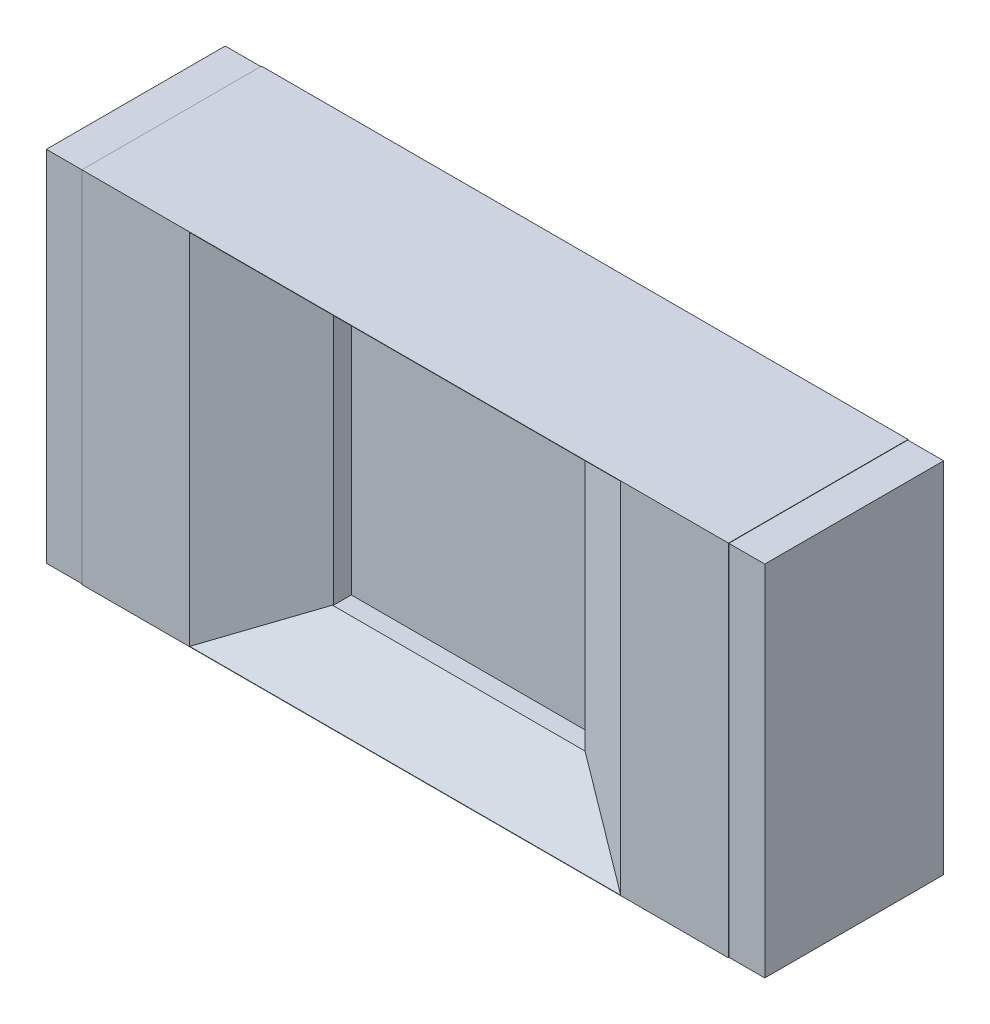
ISO-10303-21;
HEADER;
FILE_DESCRIPTION(('STEP AP214'),'2;1');
FILE_NAME('part.step','',(''),(''),'','','');
FILE_SCHEMA(('AUTOMOTIVE_DESIGN { 1 0 10303 214 1 1 1 1 }'));
ENDSEC;
DATA;
#1=APPLICATION_CONTEXT('core data for automotive mechanical design processes');
#2=APPLICATION_PROTOCOL_DEFINITION('international standard','automotive_design',2000,#1);
#3=PRODUCT_CONTEXT('',#1,'mechanical');
#4=PRODUCT('Part','Part','',(#3));
#5=PRODUCT_RELATED_PRODUCT_CATEGORY('part','',(#4));
#6=PRODUCT_DEFINITION_FORMATION('','',#4);
#7=PRODUCT_DEFINITION_CONTEXT('part definition',#1,'design');
#8=PRODUCT_DEFINITION('design','',#6,#7);
#9=PRODUCT_DEFINITION_SHAPE('','',#8);
#10=(LENGTH_UNIT() NAMED_UNIT(*) SI_UNIT(.MILLI.,.METRE.));
#11=(NAMED_UNIT(*) PLANE_ANGLE_UNIT() SI_UNIT($,.RADIAN.));
#12=(NAMED_UNIT(*) SI_UNIT($,.STERADIAN.) SOLID_ANGLE_UNIT());
#13=UNCERTAINTY_MEASURE_WITH_UNIT(LENGTH_MEASURE(1.E-05),#10,'distance_accuracy_value','');
#14=(GEOMETRIC_REPRESENTATION_CONTEXT(3) GLOBAL_UNCERTAINTY_ASSIGNED_CONTEXT((#13)) GLOBAL_UNIT_ASSIGNED_CONTEXT((#10,
#11,#12)) REPRESENTATION_CONTEXT('',''));
#15=CARTESIAN_POINT('',(0.,0.,0.));
#16=DIRECTION('',(0.,0.,1.));
#17=DIRECTION('',(1.,0.,0.));
#18=AXIS2_PLACEMENT_3D('',#15,#16,#17);
#19=CARTESIAN_POINT('',(28.13,-12.,3.201));
#20=DIRECTION('',(0.,0.,-1.));
#21=DIRECTION('',(0.,-1.,0.));
#22=AXIS2_PLACEMENT_3D('',#19,#20,#21);
#23=PLANE('',#22);
#24=DIRECTION('',(1.,0.,0.));
#25=VECTOR('',#24,1.);
#26=CARTESIAN_POINT('',(28.13,-11.999,3.201));
#27=LINE('',#26,#25);
#28=CARTESIAN_POINT('',(28.03,-11.999,3.201));
#29=VERTEX_POINT('',#28);
#30=CARTESIAN_POINT('',(28.13,-11.999,3.201));
#31=VERTEX_POINT('',#30);
#32=EDGE_CURVE('E339',#29,#31,#27,.T.);
#33=ORIENTED_EDGE('',*,*,#32,.F.);
#34=DIRECTION('',(0.,-1.,0.));
#35=VECTOR('',#34,1.);
#36=CARTESIAN_POINT('',(28.03,-12.,3.201));
#37=LINE('',#36,#35);
#38=CARTESIAN_POINT('',(28.03,-11.001,3.201));
#39=VERTEX_POINT('',#38);
#40=EDGE_CURVE('E11',#39,#29,#37,.T.);
#41=ORIENTED_EDGE('',*,*,#40,.F.);
#42=DIRECTION('',(1.,0.,0.));
#43=VECTOR('',#42,1.);
#44=CARTESIAN_POINT('',(28.13,-11.001,3.201));
#45=LINE('',#44,#43);
#46=CARTESIAN_POINT('',(28.13,-11.001,3.201));
#47=VERTEX_POINT('',#46);
#48=EDGE_CURVE('E368',#39,#47,#45,.T.);
#49=ORIENTED_EDGE('',*,*,#48,.T.);
#50=DIRECTION('',(0.,-1.,0.));
#51=VECTOR('',#50,1.);
#52=CARTESIAN_POINT('',(28.13,-12.,3.201));
#53=LINE('',#52,#51);
#54=EDGE_CURVE('E252',#47,#31,#53,.T.);
#55=ORIENTED_EDGE('',*,*,#54,.T.);
#56=EDGE_LOOP('',(#33,#41,#49,#55));
#57=FACE_BOUND('',#56,.T.);
#58=ADVANCED_FACE('F18',(#57),#23,.T.);
#59=CARTESIAN_POINT('',(28.03,-12.,3.2));
#60=DIRECTION('',(-1.,0.,0.));
#61=DIRECTION('',(0.,0.,1.));
#62=AXIS2_PLACEMENT_3D('',#59,#60,#61);
#63=PLANE('',#62);
#64=ORIENTED_EDGE('',*,*,#40,.T.);
#65=DIRECTION('',(0.,0.,1.));
#66=VECTOR('',#65,1.);
#67=CARTESIAN_POINT('',(28.03,-11.999,3.2));
#68=LINE('',#67,#66);
#69=CARTESIAN_POINT('',(28.03,-11.999,3.699));
#70=VERTEX_POINT('',#69);
#71=EDGE_CURVE('E242',#29,#70,#68,.T.);
#72=ORIENTED_EDGE('',*,*,#71,.T.);
#73=DIRECTION('',(0.,1.,0.));
#74=VECTOR('',#73,1.);
#75=CARTESIAN_POINT('',(28.03,-12.,3.699));
#76=LINE('',#75,#74);
#77=CARTESIAN_POINT('',(28.03,-11.001,3.699));
#78=VERTEX_POINT('',#77);
#79=EDGE_CURVE('E243',#70,#78,#76,.T.);
#80=ORIENTED_EDGE('',*,*,#79,.T.);
#81=DIRECTION('',(0.,0.,-1.));
#82=VECTOR('',#81,1.);
#83=CARTESIAN_POINT('',(28.03,-11.001,3.2));
#84=LINE('',#83,#82);
#85=EDGE_CURVE('E29',#78,#39,#84,.T.);
#86=ORIENTED_EDGE('',*,*,#85,.T.);
#87=EDGE_LOOP('',(#64,#72,#80,#86));
#88=FACE_BOUND('',#87,.T.);
#89=ADVANCED_FACE('F468',(#88),#63,.T.);
#90=CARTESIAN_POINT('',(28.13,-11.001,3.2));
#91=DIRECTION('',(0.,1.,0.));
#92=DIRECTION('',(1.,0.,0.));
#93=AXIS2_PLACEMENT_3D('',#90,#91,#92);
#94=PLANE('',#93);
#95=ORIENTED_EDGE('',*,*,#48,.F.);
#96=ORIENTED_EDGE('',*,*,#85,.F.);
#97=DIRECTION('',(1.,0.,0.));
#98=VECTOR('',#97,1.);
#99=CARTESIAN_POINT('',(28.13,-11.001,3.699));
#100=LINE('',#99,#98);
#101=CARTESIAN_POINT('',(28.13,-11.001,3.699));
#102=VERTEX_POINT('',#101);
#103=EDGE_CURVE('E285',#78,#102,#100,.T.);
#104=ORIENTED_EDGE('',*,*,#103,.T.);
#105=DIRECTION('',(0.,0.,-1.));
#106=VECTOR('',#105,1.);
#107=CARTESIAN_POINT('',(28.13,-11.001,3.2));
#108=LINE('',#107,#106);
#109=EDGE_CURVE('E281',#102,#47,#108,.T.);
#110=ORIENTED_EDGE('',*,*,#109,.T.);
#111=EDGE_LOOP('',(#95,#96,#104,#110));
#112=FACE_BOUND('',#111,.T.);
#113=ADVANCED_FACE('F473',(#112),#94,.T.);
#114=CARTESIAN_POINT('',(28.13,-11.999,3.2));
#115=DIRECTION('',(0.,-1.,0.));
#116=DIRECTION('',(-1.,0.,0.));
#117=AXIS2_PLACEMENT_3D('',#114,#115,#116);
#118=PLANE('',#117);
#119=DIRECTION('',(1.,0.,0.));
#120=VECTOR('',#119,1.);
#121=CARTESIAN_POINT('',(28.13,-11.999,3.699));
#122=LINE('',#121,#120);
#123=CARTESIAN_POINT('',(28.13,-11.999,3.699));
#124=VERTEX_POINT('',#123);
#125=EDGE_CURVE('E238',#70,#124,#122,.T.);
#126=ORIENTED_EDGE('',*,*,#125,.F.);
#127=ORIENTED_EDGE('',*,*,#71,.F.);
#128=ORIENTED_EDGE('',*,*,#32,.T.);
#129=DIRECTION('',(0.,0.,1.));
#130=VECTOR('',#129,1.);
#131=CARTESIAN_POINT('',(28.13,-11.999,3.2));
#132=LINE('',#131,#130);
#133=EDGE_CURVE('E248',#31,#124,#132,.T.);
#134=ORIENTED_EDGE('',*,*,#133,.T.);
#135=EDGE_LOOP('',(#126,#127,#128,#134));
#136=FACE_BOUND('',#135,.T.);
#137=ADVANCED_FACE('F518',(#136),#118,.T.);
#138=CARTESIAN_POINT('',(28.13,-12.,3.699));
#139=DIRECTION('',(0.,0.,1.));
#140=DIRECTION('',(1.,0.,0.));
#141=AXIS2_PLACEMENT_3D('',#138,#139,#140);
#142=PLANE('',#141);
#143=ORIENTED_EDGE('',*,*,#103,.F.);
#144=ORIENTED_EDGE('',*,*,#79,.F.);
#145=ORIENTED_EDGE('',*,*,#125,.T.);
#146=DIRECTION('',(0.,1.,0.));
#147=VECTOR('',#146,1.);
#148=CARTESIAN_POINT('',(28.13,-12.,3.699));
#149=LINE('',#148,#147);
#150=EDGE_CURVE('E22',#124,#102,#149,.T.);
#151=ORIENTED_EDGE('',*,*,#150,.T.);
#152=EDGE_LOOP('',(#143,#144,#145,#151));
#153=FACE_BOUND('',#152,.T.);
#154=ADVANCED_FACE('F511',(#153),#142,.T.);
#155=CARTESIAN_POINT('',(28.13,-11.5,3.45));
#156=DIRECTION('',(-1.,0.,0.));
#157=DIRECTION('',(0.,0.,1.));
#158=AXIS2_PLACEMENT_3D('',#155,#156,#157);
#159=PLANE('',#158);
#160=ORIENTED_EDGE('',*,*,#150,.F.);
#161=ORIENTED_EDGE('',*,*,#133,.F.);
#162=ORIENTED_EDGE('',*,*,#54,.F.);
#163=ORIENTED_EDGE('',*,*,#109,.F.);
#164=EDGE_LOOP('',(#160,#161,#162,#163));
#165=FACE_BOUND('',#164,.T.);
#166=DIRECTION('',(0.,1.,0.));
#167=VECTOR('',#166,1.);
#168=CARTESIAN_POINT('',(28.13,-12.,3.7));
#169=LINE('',#168,#167);
#170=CARTESIAN_POINT('',(28.13,-12.,3.7));
#171=VERTEX_POINT('',#170);
#172=CARTESIAN_POINT('',(28.13,-11.,3.7));
#173=VERTEX_POINT('',#172);
#174=EDGE_CURVE('E225',#171,#173,#169,.T.);
#175=ORIENTED_EDGE('',*,*,#174,.T.);
#176=DIRECTION('',(0.,0.,-1.));
#177=VECTOR('',#176,1.);
#178=CARTESIAN_POINT('',(28.13,-11.,3.2));
#179=LINE('',#178,#177);
#180=CARTESIAN_POINT('',(28.13,-11.,3.2));
#181=VERTEX_POINT('',#180);
#182=EDGE_CURVE('E290',#173,#181,#179,.T.);
#183=ORIENTED_EDGE('',*,*,#182,.T.);
#184=DIRECTION('',(0.,-1.,0.));
#185=VECTOR('',#184,1.);
#186=CARTESIAN_POINT('',(28.13,-12.,3.2));
#187=LINE('',#186,#185);
#188=CARTESIAN_POINT('',(28.13,-12.,3.2));
#189=VERTEX_POINT('',#188);
#190=EDGE_CURVE('E269',#181,#189,#187,.T.);
#191=ORIENTED_EDGE('',*,*,#190,.T.);
#192=DIRECTION('',(0.,0.,1.));
#193=VECTOR('',#192,1.);
#194=CARTESIAN_POINT('',(28.13,-12.,3.2));
#195=LINE('',#194,#193);
#196=EDGE_CURVE('E279',#189,#171,#195,.T.);
#197=ORIENTED_EDGE('',*,*,#196,.T.);
#198=EDGE_LOOP('',(#175,#183,#191,#197));
#199=FACE_BOUND('',#198,.T.);
#200=ADVANCED_FACE('F504',(#165,#199),#159,.T.);
#201=CARTESIAN_POINT('',(29.93,-12.,3.201));
#202=DIRECTION('',(0.,0.,-1.));
#203=DIRECTION('',(-1.,0.,0.));
#204=AXIS2_PLACEMENT_3D('',#201,#202,#203);
#205=PLANE('',#204);
#206=DIRECTION('',(0.,-1.,0.));
#207=VECTOR('',#206,1.);
#208=CARTESIAN_POINT('',(29.93,-12.,3.201));
#209=LINE('',#208,#207);
#210=CARTESIAN_POINT('',(29.93,-11.001,3.201));
#211=VERTEX_POINT('',#210);
#212=CARTESIAN_POINT('',(29.93,-11.999,3.201));
#213=VERTEX_POINT('',#212);
#214=EDGE_CURVE('E253',#211,#213,#209,.T.);
#215=ORIENTED_EDGE('',*,*,#214,.F.);
#216=DIRECTION('',(-1.,0.,0.));
#217=VECTOR('',#216,1.);
#218=CARTESIAN_POINT('',(29.93,-11.001,3.201));
#219=LINE('',#218,#217);
#220=CARTESIAN_POINT('',(30.03,-11.001,3.201));
#221=VERTEX_POINT('',#220);
#222=EDGE_CURVE('E219',#221,#211,#219,.T.);
#223=ORIENTED_EDGE('',*,*,#222,.F.);
#224=DIRECTION('',(0.,-1.,0.));
#225=VECTOR('',#224,1.);
#226=CARTESIAN_POINT('',(30.03,-12.,3.201));
#227=LINE('',#226,#225);
#228=CARTESIAN_POINT('',(30.03,-11.999,3.201));
#229=VERTEX_POINT('',#228);
#230=EDGE_CURVE('E216',#221,#229,#227,.T.);
#231=ORIENTED_EDGE('',*,*,#230,.T.);
#232=DIRECTION('',(-1.,0.,0.));
#233=VECTOR('',#232,1.);
#234=CARTESIAN_POINT('',(29.93,-11.999,3.201));
#235=LINE('',#234,#233);
#236=EDGE_CURVE('E365',#229,#213,#235,.T.);
#237=ORIENTED_EDGE('',*,*,#236,.T.);
#238=EDGE_LOOP('',(#215,#223,#231,#237));
#239=FACE_BOUND('',#238,.T.);
#240=ADVANCED_FACE('F502',(#239),#205,.T.);
#241=CARTESIAN_POINT('',(30.03,-11.,3.2));
#242=DIRECTION('',(1.,0.,0.));
#243=DIRECTION('',(0.,1.,0.));
#244=AXIS2_PLACEMENT_3D('',#241,#242,#243);
#245=PLANE('',#244);
#246=ORIENTED_EDGE('',*,*,#230,.F.);
#247=DIRECTION('',(0.,0.,-1.));
#248=VECTOR('',#247,1.);
#249=CARTESIAN_POINT('',(30.03,-11.001,3.2));
#250=LINE('',#249,#248);
#251=CARTESIAN_POINT('',(30.03,-11.001,3.699));
#252=VERTEX_POINT('',#251);
#253=EDGE_CURVE('E237',#252,#221,#250,.T.);
#254=ORIENTED_EDGE('',*,*,#253,.F.);
#255=DIRECTION('',(0.,1.,0.));
#256=VECTOR('',#255,1.);
#257=CARTESIAN_POINT('',(30.03,-12.,3.699));
#258=LINE('',#257,#256);
#259=CARTESIAN_POINT('',(30.03,-11.999,3.699));
#260=VERTEX_POINT('',#259);
#261=EDGE_CURVE('E303',#260,#252,#258,.T.);
#262=ORIENTED_EDGE('',*,*,#261,.F.);
#263=DIRECTION('',(0.,0.,1.));
#264=VECTOR('',#263,1.);
#265=CARTESIAN_POINT('',(30.03,-11.999,3.2));
#266=LINE('',#265,#264);
#267=EDGE_CURVE('E262',#229,#260,#266,.T.);
#268=ORIENTED_EDGE('',*,*,#267,.F.);
#269=EDGE_LOOP('',(#246,#254,#262,#268));
#270=FACE_BOUND('',#269,.T.);
#271=ADVANCED_FACE('F493',(#270),#245,.T.);
#272=CARTESIAN_POINT('',(29.93,-11.001,3.2));
#273=DIRECTION('',(0.,1.,0.));
#274=DIRECTION('',(1.,0.,0.));
#275=AXIS2_PLACEMENT_3D('',#272,#273,#274);
#276=PLANE('',#275);
#277=DIRECTION('',(0.,0.,-1.));
#278=VECTOR('',#277,1.);
#279=CARTESIAN_POINT('',(29.93,-11.001,3.2));
#280=LINE('',#279,#278);
#281=CARTESIAN_POINT('',(29.93,-11.001,3.699));
#282=VERTEX_POINT('',#281);
#283=EDGE_CURVE('E258',#282,#211,#280,.T.);
#284=ORIENTED_EDGE('',*,*,#283,.F.);
#285=DIRECTION('',(-1.,0.,0.));
#286=VECTOR('',#285,1.);
#287=CARTESIAN_POINT('',(29.93,-11.001,3.699));
#288=LINE('',#287,#286);
#289=EDGE_CURVE('E213',#252,#282,#288,.T.);
#290=ORIENTED_EDGE('',*,*,#289,.F.);
#291=ORIENTED_EDGE('',*,*,#253,.T.);
#292=ORIENTED_EDGE('',*,*,#222,.T.);
#293=EDGE_LOOP('',(#284,#290,#291,#292));
#294=FACE_BOUND('',#293,.T.);
#295=ADVANCED_FACE('F386',(#294),#276,.T.);
#296=CARTESIAN_POINT('',(29.93,-11.999,3.2));
#297=DIRECTION('',(0.,-1.,0.));
#298=DIRECTION('',(0.,0.,-1.));
#299=AXIS2_PLACEMENT_3D('',#296,#297,#298);
#300=PLANE('',#299);
#301=DIRECTION('',(0.,0.,1.));
#302=VECTOR('',#301,1.);
#303=CARTESIAN_POINT('',(29.93,-11.999,3.2));
#304=LINE('',#303,#302);
#305=CARTESIAN_POINT('',(29.93,-11.999,3.699));
#306=VERTEX_POINT('',#305);
#307=EDGE_CURVE('E257',#213,#306,#304,.T.);
#308=ORIENTED_EDGE('',*,*,#307,.F.);
#309=ORIENTED_EDGE('',*,*,#236,.F.);
#310=ORIENTED_EDGE('',*,*,#267,.T.);
#311=DIRECTION('',(-1.,0.,0.));
#312=VECTOR('',#311,1.);
#313=CARTESIAN_POINT('',(29.93,-11.999,3.699));
#314=LINE('',#313,#312);
#315=EDGE_CURVE('E266',#260,#306,#314,.T.);
#316=ORIENTED_EDGE('',*,*,#315,.T.);
#317=EDGE_LOOP('',(#308,#309,#310,#316));
#318=FACE_BOUND('',#317,.T.);
#319=ADVANCED_FACE('F485',(#318),#300,.T.);
#320=CARTESIAN_POINT('',(29.93,-12.,3.699));
#321=DIRECTION('',(0.,0.,1.));
#322=DIRECTION('',(1.,0.,0.));
#323=AXIS2_PLACEMENT_3D('',#320,#321,#322);
#324=PLANE('',#323);
#325=DIRECTION('',(0.,1.,0.));
#326=VECTOR('',#325,1.);
#327=CARTESIAN_POINT('',(29.93,-12.,3.699));
#328=LINE('',#327,#326);
#329=EDGE_CURVE('E321',#306,#282,#328,.T.);
#330=ORIENTED_EDGE('',*,*,#329,.F.);
#331=ORIENTED_EDGE('',*,*,#315,.F.);
#332=ORIENTED_EDGE('',*,*,#261,.T.);
#333=ORIENTED_EDGE('',*,*,#289,.T.);
#334=EDGE_LOOP('',(#330,#331,#332,#333));
#335=FACE_BOUND('',#334,.T.);
#336=ADVANCED_FACE('F480',(#335),#324,.T.);
#337=CARTESIAN_POINT('',(29.93,-11.5,3.45));
#338=DIRECTION('',(1.,0.,0.));
#339=DIRECTION('',(0.,1.,0.));
#340=AXIS2_PLACEMENT_3D('',#337,#338,#339);
#341=PLANE('',#340);
#342=ORIENTED_EDGE('',*,*,#329,.T.);
#343=ORIENTED_EDGE('',*,*,#283,.T.);
#344=ORIENTED_EDGE('',*,*,#214,.T.);
#345=ORIENTED_EDGE('',*,*,#307,.T.);
#346=EDGE_LOOP('',(#342,#343,#344,#345));
#347=FACE_BOUND('',#346,.T.);
#348=DIRECTION('',(0.,1.,0.));
#349=VECTOR('',#348,1.);
#350=CARTESIAN_POINT('',(29.93,-12.,3.7));
#351=LINE('',#350,#349);
#352=CARTESIAN_POINT('',(29.93,-12.,3.7));
#353=VERTEX_POINT('',#352);
#354=CARTESIAN_POINT('',(29.93,-11.,3.7));
#355=VERTEX_POINT('',#354);
#356=EDGE_CURVE('E300',#353,#355,#351,.T.);
#357=ORIENTED_EDGE('',*,*,#356,.F.);
#358=DIRECTION('',(0.,0.,1.));
#359=VECTOR('',#358,1.);
#360=CARTESIAN_POINT('',(29.93,-12.,3.2));
#361=LINE('',#360,#359);
#362=CARTESIAN_POINT('',(29.93,-12.,3.2));
#363=VERTEX_POINT('',#362);
#364=EDGE_CURVE('E276',#363,#353,#361,.T.);
#365=ORIENTED_EDGE('',*,*,#364,.F.);
#366=DIRECTION('',(0.,-1.,0.));
#367=VECTOR('',#366,1.);
#368=CARTESIAN_POINT('',(29.93,-12.,3.2));
#369=LINE('',#368,#367);
#370=CARTESIAN_POINT('',(29.93,-11.,3.2));
#371=VERTEX_POINT('',#370);
#372=EDGE_CURVE('E314',#371,#363,#369,.T.);
#373=ORIENTED_EDGE('',*,*,#372,.F.);
#374=DIRECTION('',(0.,0.,-1.));
#375=VECTOR('',#374,1.);
#376=CARTESIAN_POINT('',(29.93,-11.,3.2));
#377=LINE('',#376,#375);
#378=EDGE_CURVE('E210',#355,#371,#377,.T.);
#379=ORIENTED_EDGE('',*,*,#378,.F.);
#380=EDGE_LOOP('',(#357,#365,#373,#379));
#381=FACE_BOUND('',#380,.T.);
#382=ADVANCED_FACE('F380',(#347,#381),#341,.T.);
#383=CARTESIAN_POINT('',(29.03,-11.5,3.5));
#384=DIRECTION('',(0.,0.,-1.));
#385=DIRECTION('',(0.,-1.,0.));
#386=AXIS2_PLACEMENT_3D('',#383,#384,#385);
#387=PLANE('',#386);
#388=DIRECTION('',(0.,1.,0.));
#389=VECTOR('',#388,1.);
#390=CARTESIAN_POINT('',(28.68,-11.85,3.5));
#391=LINE('',#390,#389);
#392=CARTESIAN_POINT('',(28.68,-11.85,3.5));
#393=VERTEX_POINT('',#392);
#394=CARTESIAN_POINT('',(28.68,-11.15,3.5));
#395=VERTEX_POINT('',#394);
#396=EDGE_CURVE('E274',#393,#395,#391,.T.);
#397=ORIENTED_EDGE('',*,*,#396,.F.);
#398=DIRECTION('',(-1.,0.,0.));
#399=VECTOR('',#398,1.);
#400=CARTESIAN_POINT('',(29.38,-11.85,3.5));
#401=LINE('',#400,#399);
#402=CARTESIAN_POINT('',(29.38,-11.85,3.5));
#403=VERTEX_POINT('',#402);
#404=EDGE_CURVE('E275',#403,#393,#401,.T.);
#405=ORIENTED_EDGE('',*,*,#404,.F.);
#406=DIRECTION('',(0.,-1.,0.));
#407=VECTOR('',#406,1.);
#408=CARTESIAN_POINT('',(29.38,-11.15,3.5));
#409=LINE('',#408,#407);
#410=CARTESIAN_POINT('',(29.38,-11.15,3.5));
#411=VERTEX_POINT('',#410);
#412=EDGE_CURVE('E317',#411,#403,#409,.T.);
#413=ORIENTED_EDGE('',*,*,#412,.F.);
#414=DIRECTION('',(1.,0.,0.));
#415=VECTOR('',#414,1.);
#416=CARTESIAN_POINT('',(28.68,-11.15,3.5));
#417=LINE('',#416,#415);
#418=EDGE_CURVE('E244',#395,#411,#417,.T.);
#419=ORIENTED_EDGE('',*,*,#418,.F.);
#420=EDGE_LOOP('',(#397,#405,#413,#419));
#421=FACE_BOUND('',#420,.T.);
#422=ADVANCED_FACE('F416',(#421),#387,.F.);
#423=CARTESIAN_POINT('',(29.38,-11.15,3.7));
#424=DIRECTION('',(-1.,0.,0.));
#425=DIRECTION('',(0.,0.,1.));
#426=AXIS2_PLACEMENT_3D('',#423,#424,#425);
#427=PLANE('',#426);
#428=DIRECTION('',(0.,0.,-1.));
#429=VECTOR('',#428,1.);
#430=CARTESIAN_POINT('',(29.38,-11.15,3.7));
#431=LINE('',#430,#429);
#432=CARTESIAN_POINT('',(29.38,-11.15,3.55));
#433=VERTEX_POINT('',#432);
#434=EDGE_CURVE('E182',#433,#411,#431,.T.);
#435=ORIENTED_EDGE('',*,*,#434,.T.);
#436=ORIENTED_EDGE('',*,*,#412,.T.);
#437=DIRECTION('',(0.,0.,-1.));
#438=VECTOR('',#437,1.);
#439=CARTESIAN_POINT('',(29.38,-11.85,3.7));
#440=LINE('',#439,#438);
#441=CARTESIAN_POINT('',(29.38,-11.85,3.55));
#442=VERTEX_POINT('',#441);
#443=EDGE_CURVE('E331',#442,#403,#440,.T.);
#444=ORIENTED_EDGE('',*,*,#443,.F.);
#445=DIRECTION('',(0.,-1.,0.));
#446=VECTOR('',#445,1.);
#447=CARTESIAN_POINT('',(29.38,-11.15,3.55));
#448=LINE('',#447,#446);
#449=EDGE_CURVE('E295',#433,#442,#448,.T.);
#450=ORIENTED_EDGE('',*,*,#449,.F.);
#451=EDGE_LOOP('',(#435,#436,#444,#450));
#452=FACE_BOUND('',#451,.T.);
#453=ADVANCED_FACE('F410',(#452),#427,.T.);
#454=CARTESIAN_POINT('',(28.68,-11.85,3.7));
#455=DIRECTION('',(1.,0.,0.));
#456=DIRECTION('',(0.,1.,0.));
#457=AXIS2_PLACEMENT_3D('',#454,#455,#456);
#458=PLANE('',#457);
#459=DIRECTION('',(0.,0.,-1.));
#460=VECTOR('',#459,1.);
#461=CARTESIAN_POINT('',(28.68,-11.85,3.7));
#462=LINE('',#461,#460);
#463=CARTESIAN_POINT('',(28.68,-11.85,3.55));
#464=VERTEX_POINT('',#463);
#465=EDGE_CURVE('E270',#464,#393,#462,.T.);
#466=ORIENTED_EDGE('',*,*,#465,.T.);
#467=ORIENTED_EDGE('',*,*,#396,.T.);
#468=DIRECTION('',(0.,0.,-1.));
#469=VECTOR('',#468,1.);
#470=CARTESIAN_POINT('',(28.68,-11.15,3.7));
#471=LINE('',#470,#469);
#472=CARTESIAN_POINT('',(28.68,-11.15,3.55));
#473=VERTEX_POINT('',#472);
#474=EDGE_CURVE('E247',#473,#395,#471,.T.);
#475=ORIENTED_EDGE('',*,*,#474,.F.);
#476=DIRECTION('',(0.,1.,0.));
#477=VECTOR('',#476,1.);
#478=CARTESIAN_POINT('',(28.68,-11.85,3.55));
#479=LINE('',#478,#477);
#480=EDGE_CURVE('E200',#464,#473,#479,.T.);
#481=ORIENTED_EDGE('',*,*,#480,.F.);
#482=EDGE_LOOP('',(#466,#467,#475,#481));
#483=FACE_BOUND('',#482,.T.);
#484=ADVANCED_FACE('F454',(#483),#458,.T.);
#485=CARTESIAN_POINT('',(29.38,-11.85,3.7));
#486=DIRECTION('',(0.,1.,0.));
#487=DIRECTION('',(1.,0.,0.));
#488=AXIS2_PLACEMENT_3D('',#485,#486,#487);
#489=PLANE('',#488);
#490=DIRECTION('',(-0.857492925712456,0.,-0.514495755427674));
#491=VECTOR('',#490,1.);
#492=CARTESIAN_POINT('',(29.475588235294,-11.85,3.607352941176));
#493=LINE('',#492,#491);
#494=CARTESIAN_POINT('',(29.381666666666,-11.85,3.551));
#495=VERTEX_POINT('',#494);
#496=EDGE_CURVE('E328',#495,#442,#493,.T.);
#497=ORIENTED_EDGE('',*,*,#496,.T.);
#498=ORIENTED_EDGE('',*,*,#443,.T.);
#499=ORIENTED_EDGE('',*,*,#404,.T.);
#500=ORIENTED_EDGE('',*,*,#465,.F.);
#501=DIRECTION('',(0.857492925712456,0.,-0.514495755427674));
#502=VECTOR('',#501,1.);
#503=CARTESIAN_POINT('',(28.841764705882,-11.85,3.452941176471));
#504=LINE('',#503,#502);
#505=CARTESIAN_POINT('',(28.678333333333,-11.85,3.551));
#506=VERTEX_POINT('',#505);
#507=EDGE_CURVE('E291',#506,#464,#504,.T.);
#508=ORIENTED_EDGE('',*,*,#507,.F.);
#509=DIRECTION('',(-1.,0.,0.));
#510=VECTOR('',#509,1.);
#511=CARTESIAN_POINT('',(28.68,-11.85,3.551));
#512=LINE('',#511,#510);
#513=EDGE_CURVE('E187',#495,#506,#512,.T.);
#514=ORIENTED_EDGE('',*,*,#513,.F.);
#515=EDGE_LOOP('',(#497,#498,#499,#500,#508,#514));
#516=FACE_BOUND('',#515,.T.);
#517=ADVANCED_FACE('F419',(#516),#489,.T.);
#518=CARTESIAN_POINT('',(28.68,-11.15,3.7));
#519=DIRECTION('',(0.,-1.,0.));
#520=DIRECTION('',(0.,0.,-1.));
#521=AXIS2_PLACEMENT_3D('',#518,#519,#520);
#522=PLANE('',#521);
#523=DIRECTION('',(0.857492925712456,0.,-0.514495755427674));
#524=VECTOR('',#523,1.);
#525=CARTESIAN_POINT('',(28.584411764705,-11.15,3.607352941176));
#526=LINE('',#525,#524);
#527=CARTESIAN_POINT('',(28.678333333333,-11.15,3.551));
#528=VERTEX_POINT('',#527);
#529=EDGE_CURVE('E234',#528,#473,#526,.T.);
#530=ORIENTED_EDGE('',*,*,#529,.T.);
#531=ORIENTED_EDGE('',*,*,#474,.T.);
#532=ORIENTED_EDGE('',*,*,#418,.T.);
#533=ORIENTED_EDGE('',*,*,#434,.F.);
#534=DIRECTION('',(-0.857492925712456,0.,-0.514495755427674));
#535=VECTOR('',#534,1.);
#536=CARTESIAN_POINT('',(29.218235294117,-11.15,3.452941176471));
#537=LINE('',#536,#535);
#538=CARTESIAN_POINT('',(29.381666666666,-11.15,3.551));
#539=VERTEX_POINT('',#538);
#540=EDGE_CURVE('E174',#539,#433,#537,.T.);
#541=ORIENTED_EDGE('',*,*,#540,.F.);
#542=DIRECTION('',(1.,0.,0.));
#543=VECTOR('',#542,1.);
#544=CARTESIAN_POINT('',(29.38,-11.15,3.551));
#545=LINE('',#544,#543);
#546=EDGE_CURVE('E178',#528,#539,#545,.T.);
#547=ORIENTED_EDGE('',*,*,#546,.F.);
#548=EDGE_LOOP('',(#530,#531,#532,#533,#541,#547));
#549=FACE_BOUND('',#548,.T.);
#550=ADVANCED_FACE('F20',(#549),#522,.T.);
#551=CARTESIAN_POINT('',(29.03,-11.5,3.2));
#552=DIRECTION('',(0.,0.,-1.));
#553=DIRECTION('',(0.,-1.,0.));
#554=AXIS2_PLACEMENT_3D('',#551,#552,#553);
#555=PLANE('',#554);
#556=DIRECTION('',(-1.,0.,0.));
#557=VECTOR('',#556,1.);
#558=CARTESIAN_POINT('',(30.03,-12.,3.2));
#559=LINE('',#558,#557);
#560=EDGE_CURVE('E280',#363,#189,#559,.T.);
#561=ORIENTED_EDGE('',*,*,#560,.T.);
#562=ORIENTED_EDGE('',*,*,#190,.F.);
#563=DIRECTION('',(1.,0.,0.));
#564=VECTOR('',#563,1.);
#565=CARTESIAN_POINT('',(28.03,-11.,3.2));
#566=LINE('',#565,#564);
#567=EDGE_CURVE('E286',#181,#371,#566,.T.);
#568=ORIENTED_EDGE('',*,*,#567,.T.);
#569=ORIENTED_EDGE('',*,*,#372,.T.);
#570=EDGE_LOOP('',(#561,#562,#568,#569));
#571=FACE_BOUND('',#570,.T.);
#572=ADVANCED_FACE('F483',(#571),#555,.T.);
#573=CARTESIAN_POINT('',(29.03,-11.93898373043,3.639983730433));
#574=DIRECTION('',(0.,0.707106781186548,0.707106781186548));
#575=DIRECTION('',(1.,0.,0.));
#576=AXIS2_PLACEMENT_3D('',#573,#574,#575);
#577=PLANE('',#576);
#578=DIRECTION('',(-1.,0.,0.));
#579=VECTOR('',#578,1.);
#580=CARTESIAN_POINT('',(29.63,-11.999,3.7));
#581=LINE('',#580,#579);
#582=CARTESIAN_POINT('',(29.63,-11.999,3.7));
#583=VERTEX_POINT('',#582);
#584=CARTESIAN_POINT('',(28.43,-11.999,3.7));
#585=VERTEX_POINT('',#584);
#586=EDGE_CURVE('E220',#583,#585,#581,.T.);
#587=ORIENTED_EDGE('',*,*,#586,.F.);
#588=DIRECTION('',(-0.762492851662884,0.45749571099793,-0.45749571099793));
#589=VECTOR('',#588,1.);
#590=CARTESIAN_POINT('',(29.406511627907,-11.86490697674,3.565906976744));
#591=LINE('',#590,#589);
#592=EDGE_CURVE('E188',#583,#495,#591,.T.);
#593=ORIENTED_EDGE('',*,*,#592,.T.);
#594=ORIENTED_EDGE('',*,*,#513,.T.);
#595=DIRECTION('',(0.762492851662884,0.45749571099793,-0.45749571099793));
#596=VECTOR('',#595,1.);
#597=CARTESIAN_POINT('',(28.604069767441,-11.89455813953,3.595558139535));
#598=LINE('',#597,#596);
#599=EDGE_CURVE('E296',#585,#506,#598,.T.);
#600=ORIENTED_EDGE('',*,*,#599,.F.);
#601=EDGE_LOOP('',(#587,#593,#594,#600));
#602=FACE_BOUND('',#601,.T.);
#603=ADVANCED_FACE('F445',(#602),#577,.T.);
#604=CARTESIAN_POINT('',(29.505,-11.15,3.625));
#605=DIRECTION('',(0.514495755427674,0.,-0.857492925712456));
#606=DIRECTION('',(0.,-1.,0.));
#607=AXIS2_PLACEMENT_3D('',#604,#605,#606);
#608=PLANE('',#607);
#609=ORIENTED_EDGE('',*,*,#449,.T.);
#610=ORIENTED_EDGE('',*,*,#496,.F.);
#611=ORIENTED_EDGE('',*,*,#592,.F.);
#612=DIRECTION('',(0.,1.,0.));
#613=VECTOR('',#612,1.);
#614=CARTESIAN_POINT('',(29.63,-11.325,3.7));
#615=LINE('',#614,#613);
#616=CARTESIAN_POINT('',(29.63,-11.001,3.7));
#617=VERTEX_POINT('',#616);
#618=EDGE_CURVE('E195',#583,#617,#615,.T.);
#619=ORIENTED_EDGE('',*,*,#618,.T.);
#620=DIRECTION('',(-0.762492851662884,-0.45749571099793,-0.45749571099793));
#621=VECTOR('',#620,1.);
#622=CARTESIAN_POINT('',(29.455930232558,-11.10544186046,3.595558139535));
#623=LINE('',#622,#621);
#624=EDGE_CURVE('E191',#617,#539,#623,.T.);
#625=ORIENTED_EDGE('',*,*,#624,.T.);
#626=ORIENTED_EDGE('',*,*,#540,.T.);
#627=EDGE_LOOP('',(#609,#610,#611,#619,#625,#626));
#628=FACE_BOUND('',#627,.T.);
#629=ADVANCED_FACE('F192',(#628),#608,.F.);
#630=CARTESIAN_POINT('',(28.555,-11.85,3.625));
#631=DIRECTION('',(-0.514495755427674,0.,-0.857492925712456));
#632=DIRECTION('',(-0.857492925712456,0.,0.514495755427674));
#633=AXIS2_PLACEMENT_3D('',#630,#631,#632);
#634=PLANE('',#633);
#635=ORIENTED_EDGE('',*,*,#480,.T.);
#636=ORIENTED_EDGE('',*,*,#529,.F.);
#637=DIRECTION('',(0.762492851662884,-0.45749571099793,-0.45749571099793));
#638=VECTOR('',#637,1.);
#639=CARTESIAN_POINT('',(28.653488372093,-11.13509302325,3.565906976744));
#640=LINE('',#639,#638);
#641=CARTESIAN_POINT('',(28.43,-11.001,3.7));
#642=VERTEX_POINT('',#641);
#643=EDGE_CURVE('E203',#642,#528,#640,.T.);
#644=ORIENTED_EDGE('',*,*,#643,.F.);
#645=DIRECTION('',(0.,-1.,0.));
#646=VECTOR('',#645,1.);
#647=CARTESIAN_POINT('',(28.43,-11.675,3.7));
#648=LINE('',#647,#646);
#649=EDGE_CURVE('E224',#642,#585,#648,.T.);
#650=ORIENTED_EDGE('',*,*,#649,.T.);
#651=ORIENTED_EDGE('',*,*,#599,.T.);
#652=ORIENTED_EDGE('',*,*,#507,.T.);
#653=EDGE_LOOP('',(#635,#636,#644,#650,#651,#652));
#654=FACE_BOUND('',#653,.T.);
#655=ADVANCED_FACE('F451',(#654),#634,.F.);
#656=CARTESIAN_POINT('',(29.03,-11.06101626956,3.639983730433));
#657=DIRECTION('',(0.,-0.707106781186548,0.707106781186548));
#658=DIRECTION('',(-1.,0.,0.));
#659=AXIS2_PLACEMENT_3D('',#656,#657,#658);
#660=PLANE('',#659);
#661=ORIENTED_EDGE('',*,*,#643,.T.);
#662=ORIENTED_EDGE('',*,*,#546,.T.);
#663=ORIENTED_EDGE('',*,*,#624,.F.);
#664=DIRECTION('',(1.,0.,0.));
#665=VECTOR('',#664,1.);
#666=CARTESIAN_POINT('',(28.43,-11.001,3.7));
#667=LINE('',#666,#665);
#668=EDGE_CURVE('E335',#642,#617,#667,.T.);
#669=ORIENTED_EDGE('',*,*,#668,.F.);
#670=EDGE_LOOP('',(#661,#662,#663,#669));
#671=FACE_BOUND('',#670,.T.);
#672=ADVANCED_FACE('F202',(#671),#660,.T.);
#673=CARTESIAN_POINT('',(28.03,-11.,3.2));
#674=DIRECTION('',(0.,1.,0.));
#675=DIRECTION('',(1.,0.,0.));
#676=AXIS2_PLACEMENT_3D('',#673,#674,#675);
#677=PLANE('',#676);
#678=ORIENTED_EDGE('',*,*,#567,.F.);
#679=ORIENTED_EDGE('',*,*,#182,.F.);
#680=DIRECTION('',(1.,0.,0.));
#681=VECTOR('',#680,1.);
#682=CARTESIAN_POINT('',(28.03,-11.,3.7));
#683=LINE('',#682,#681);
#684=EDGE_CURVE('E230',#173,#355,#683,.T.);
#685=ORIENTED_EDGE('',*,*,#684,.T.);
#686=ORIENTED_EDGE('',*,*,#378,.T.);
#687=EDGE_LOOP('',(#678,#679,#685,#686));
#688=FACE_BOUND('',#687,.T.);
#689=ADVANCED_FACE('F522',(#688),#677,.T.);
#690=CARTESIAN_POINT('',(30.03,-12.,3.2));
#691=DIRECTION('',(0.,-1.,0.));
#692=DIRECTION('',(0.,0.,-1.));
#693=AXIS2_PLACEMENT_3D('',#690,#691,#692);
#694=PLANE('',#693);
#695=ORIENTED_EDGE('',*,*,#560,.F.);
#696=ORIENTED_EDGE('',*,*,#364,.T.);
#697=DIRECTION('',(-1.,0.,0.));
#698=VECTOR('',#697,1.);
#699=CARTESIAN_POINT('',(30.03,-12.,3.7));
#700=LINE('',#699,#698);
#701=EDGE_CURVE('E229',#353,#171,#700,.T.);
#702=ORIENTED_EDGE('',*,*,#701,.T.);
#703=ORIENTED_EDGE('',*,*,#196,.F.);
#704=EDGE_LOOP('',(#695,#696,#702,#703));
#705=FACE_BOUND('',#704,.T.);
#706=ADVANCED_FACE('F525',(#705),#694,.T.);
#707=CARTESIAN_POINT('',(29.03,-11.5,3.7));
#708=DIRECTION('',(0.,0.,-1.));
#709=DIRECTION('',(0.,-1.,0.));
#710=AXIS2_PLACEMENT_3D('',#707,#708,#709);
#711=PLANE('',#710);
#712=ORIENTED_EDGE('',*,*,#618,.F.);
#713=ORIENTED_EDGE('',*,*,#586,.T.);
#714=ORIENTED_EDGE('',*,*,#649,.F.);
#715=ORIENTED_EDGE('',*,*,#668,.T.);
#716=EDGE_LOOP('',(#712,#713,#714,#715));
#717=FACE_BOUND('',#716,.T.);
#718=ORIENTED_EDGE('',*,*,#356,.T.);
#719=ORIENTED_EDGE('',*,*,#684,.F.);
#720=ORIENTED_EDGE('',*,*,#174,.F.);
#721=ORIENTED_EDGE('',*,*,#701,.F.);
#722=EDGE_LOOP('',(#718,#719,#720,#721));
#723=FACE_BOUND('',#722,.T.);
#724=ADVANCED_FACE('F448',(#717,#723),#711,.F.);
#725=CLOSED_SHELL('',(#58,#89,#113,#137,#154,#200,#240,#271,#295,#319,#336,#382,#422,#453,#484,
#517,#550,#572,#603,#629,#655,#672,#689,#706,#724));
#726=MANIFOLD_SOLID_BREP('B1',#725);
#727=ADVANCED_BREP_SHAPE_REPRESENTATION('',(#18,#726),#14);
#728=SHAPE_DEFINITION_REPRESENTATION(#9,#727);
ENDSEC;
END-ISO-10303-21;
